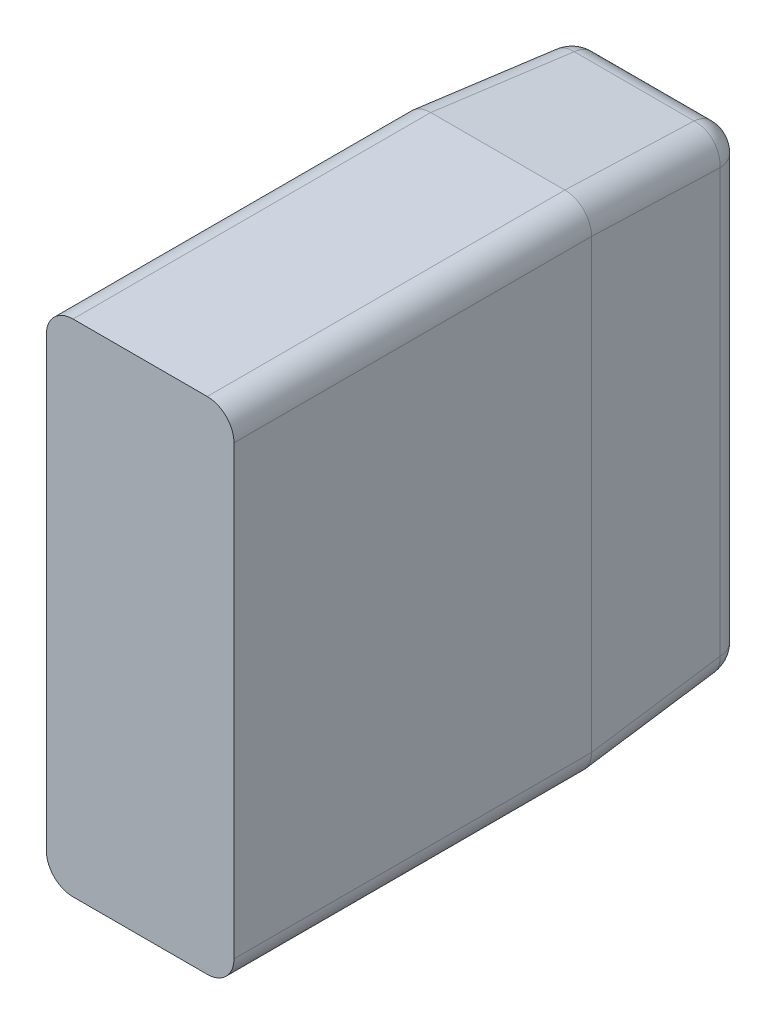
ISO-10303-21;
HEADER;
FILE_DESCRIPTION(('STEP AP214'),'2;1');
FILE_NAME('part.step','',(''),(''),'','','');
FILE_SCHEMA(('AUTOMOTIVE_DESIGN { 1 0 10303 214 1 1 1 1 }'));
ENDSEC;
DATA;
#1=APPLICATION_CONTEXT('core data for automotive mechanical design processes');
#2=APPLICATION_PROTOCOL_DEFINITION('international standard','automotive_design',2000,#1);
#3=PRODUCT_CONTEXT('',#1,'mechanical');
#4=PRODUCT('Part','Part','',(#3));
#5=PRODUCT_RELATED_PRODUCT_CATEGORY('part','',(#4));
#6=PRODUCT_DEFINITION_FORMATION('','',#4);
#7=PRODUCT_DEFINITION_CONTEXT('part definition',#1,'design');
#8=PRODUCT_DEFINITION('design','',#6,#7);
#9=PRODUCT_DEFINITION_SHAPE('','',#8);
#10=(LENGTH_UNIT() NAMED_UNIT(*) SI_UNIT(.MILLI.,.METRE.));
#11=(NAMED_UNIT(*) PLANE_ANGLE_UNIT() SI_UNIT($,.RADIAN.));
#12=(NAMED_UNIT(*) SI_UNIT($,.STERADIAN.) SOLID_ANGLE_UNIT());
#13=UNCERTAINTY_MEASURE_WITH_UNIT(LENGTH_MEASURE(1.E-05),#10,'distance_accuracy_value','');
#14=(GEOMETRIC_REPRESENTATION_CONTEXT(3) GLOBAL_UNCERTAINTY_ASSIGNED_CONTEXT((#13)) GLOBAL_UNIT_ASSIGNED_CONTEXT((#10,
#11,#12)) REPRESENTATION_CONTEXT('',''));
#15=CARTESIAN_POINT('',(0.,0.,0.));
#16=DIRECTION('',(0.,0.,1.));
#17=DIRECTION('',(1.,0.,0.));
#18=AXIS2_PLACEMENT_3D('',#15,#16,#17);
#19=CARTESIAN_POINT('',(14.4972590695092,80.,50.1046719124859));
#20=DIRECTION('',(0.998629534754574,0.,0.0523359562429439));
#21=DIRECTION('',(0.052335956242944,0.,-0.998629534754574));
#22=AXIS2_PLACEMENT_3D('',#19,#20,#21);
#23=PLANE('',#22);
#24=DIRECTION('',(0.,-1.,0.));
#25=VECTOR('',#24,1.);
#26=CARTESIAN_POINT('',(14.5027446919958,80.,50.));
#27=LINE('',#26,#25);
#28=CARTESIAN_POINT('',(14.5027446919958,25.0053627791186,50.));
#29=VERTEX_POINT('',#28);
#30=CARTESIAN_POINT('',(14.5027446919958,74.9946372208814,50.));
#31=VERTEX_POINT('',#30);
#32=EDGE_CURVE('E12',#29,#31,#27,.F.);
#33=ORIENTED_EDGE('',*,*,#32,.T.);
#34=DIRECTION('',(0.0521373445210819,-0.0870372042918475,-0.994839797341938));
#35=VECTOR('',#34,1.);
#36=CARTESIAN_POINT('',(14.4745868464784,75.0416434536543,50.5372836991502));
#37=LINE('',#36,#35);
#38=CARTESIAN_POINT('',(15.2970898149715,73.6685708593944,34.8429921312712));
#39=VERTEX_POINT('',#38);
#40=EDGE_CURVE('E245',#39,#31,#37,.F.);
#41=ORIENTED_EDGE('',*,*,#40,.F.);
#42=DIRECTION('',(0.,1.,0.));
#43=VECTOR('',#42,1.);
#44=CARTESIAN_POINT('',(15.2970898149715,80.,34.8429921312712));
#45=LINE('',#44,#43);
#46=CARTESIAN_POINT('',(15.2970898149715,26.3314291406056,34.8429921312712));
#47=VERTEX_POINT('',#46);
#48=EDGE_CURVE('E249',#47,#39,#45,.T.);
#49=ORIENTED_EDGE('',*,*,#48,.F.);
#50=DIRECTION('',(0.0521373445210819,0.0870372042918475,-0.994839797341938));
#51=VECTOR('',#50,1.);
#52=CARTESIAN_POINT('',(14.4745868464784,24.9583565463457,50.5372836991502));
#53=LINE('',#52,#51);
#54=EDGE_CURVE('E103',#29,#47,#53,.T.);
#55=ORIENTED_EDGE('',*,*,#54,.F.);
#56=EDGE_LOOP('',(#33,#41,#49,#55));
#57=FACE_BOUND('',#56,.T.);
#58=ADVANCED_FACE('F38',(#57),#23,.F.);
#59=CARTESIAN_POINT('',(17.4704754507421,24.9583565463457,50.6942915678791));
#60=DIRECTION('',(0.0521373445210819,0.0870372042918475,-0.994839797341938));
#61=DIRECTION('',(0.,0.996194698091746,0.0871557427476584));
#62=AXIS2_PLACEMENT_3D('',#59,#60,#61);
#63=CYLINDRICAL_SURFACE('',#62,3.);
#64=CARTESIAN_POINT('',(17.5068617299896,25.0190991877167,50.));
#65=DIRECTION('',(0.,0.,1.));
#66=DIRECTION('',(0.5138797648823,0.857862219266306,0.));
#67=AXIS2_PLACEMENT_3D('',#64,#65,#66);
#68=ELLIPSE('',#67,3.01556090539959,3.);
#69=CARTESIAN_POINT('',(17.4931588132021,22.0076396750867,50.));
#70=VERTEX_POINT('',#69);
#71=EDGE_CURVE('E46',#70,#29,#68,.F.);
#72=ORIENTED_EDGE('',*,*,#71,.T.);
#73=ORIENTED_EDGE('',*,*,#54,.T.);
#74=CARTESIAN_POINT('',(18.2929784192352,26.3314291406056,35.));
#75=DIRECTION('',(0.0521373445210819,0.0870372042918475,-0.994839797341938));
#76=DIRECTION('',(0.,0.996194698091746,0.0871557427476584));
#77=AXIS2_PLACEMENT_3D('',#74,#75,#76);
#78=CIRCLE('',#77,3.);
#79=CARTESIAN_POINT('',(18.2929784192352,23.3428450463304,34.738532771757));
#80=VERTEX_POINT('',#79);
#81=EDGE_CURVE('E310',#47,#80,#78,.F.);
#82=ORIENTED_EDGE('',*,*,#81,.T.);
#83=DIRECTION('',(0.0521373445210819,0.0870372042918475,-0.994839797341938));
#84=VECTOR('',#83,1.);
#85=CARTESIAN_POINT('',(17.4704754507421,21.9697724520704,50.4328243396361));
#86=LINE('',#85,#84);
#87=EDGE_CURVE('E248',#80,#70,#86,.F.);
#88=ORIENTED_EDGE('',*,*,#87,.T.);
#89=EDGE_LOOP('',(#72,#73,#82,#88));
#90=FACE_BOUND('',#89,.T.);
#91=ADVANCED_FACE('F334',(#90),#63,.T.);
#92=CARTESIAN_POINT('',(12.5,21.9923893961835,50.1743114854953));
#93=DIRECTION('',(0.,0.996194698091746,0.0871557427476584));
#94=DIRECTION('',(0.,-0.0871557427476584,0.996194698091746));
#95=AXIS2_PLACEMENT_3D('',#92,#93,#94);
#96=PLANE('',#95);
#97=DIRECTION('',(1.,0.,0.));
#98=VECTOR('',#97,1.);
#99=CARTESIAN_POINT('',(12.5,22.0076396750867,50.));
#100=LINE('',#99,#98);
#101=CARTESIAN_POINT('',(32.5068411867979,22.0076396750867,50.));
#102=VERTEX_POINT('',#101);
#103=EDGE_CURVE('E237',#102,#70,#100,.F.);
#104=ORIENTED_EDGE('',*,*,#103,.T.);
#105=ORIENTED_EDGE('',*,*,#87,.F.);
#106=DIRECTION('',(1.,0.,0.));
#107=VECTOR('',#106,1.);
#108=CARTESIAN_POINT('',(12.5,23.3428450463304,34.738532771757));
#109=LINE('',#108,#107);
#110=CARTESIAN_POINT('',(31.7070215807648,23.3428450463304,34.738532771757));
#111=VERTEX_POINT('',#110);
#112=EDGE_CURVE('E295',#111,#80,#109,.F.);
#113=ORIENTED_EDGE('',*,*,#112,.F.);
#114=DIRECTION('',(-0.0521373445210819,0.0870372042918475,-0.994839797341938));
#115=VECTOR('',#114,1.);
#116=CARTESIAN_POINT('',(32.2572512268789,22.4243009479269,45.2375398589015));
#117=LINE('',#116,#115);
#118=EDGE_CURVE('E292',#102,#111,#117,.T.);
#119=ORIENTED_EDGE('',*,*,#118,.F.);
#120=EDGE_LOOP('',(#104,#105,#113,#119));
#121=FACE_BOUND('',#120,.T.);
#122=ADVANCED_FACE('F358',(#121),#96,.F.);
#123=CARTESIAN_POINT('',(0.,26.3314291406056,35.));
#124=DIRECTION('',(-1.,0.,0.));
#125=DIRECTION('',(0.,0.,1.));
#126=AXIS2_PLACEMENT_3D('',#123,#124,#125);
#127=CYLINDRICAL_SURFACE('',#126,3.);
#128=CARTESIAN_POINT('',(18.2929784192352,26.3314291406056,35.));
#129=DIRECTION('',(-1.,0.,0.));
#130=DIRECTION('',(0.,-1.,0.));
#131=AXIS2_PLACEMENT_3D('',#128,#129,#130);
#132=CIRCLE('',#131,3.);
#133=CARTESIAN_POINT('',(18.2929784192352,26.3314291406056,32.));
#134=VERTEX_POINT('',#133);
#135=EDGE_CURVE('E294',#80,#134,#132,.F.);
#136=ORIENTED_EDGE('',*,*,#135,.T.);
#137=DIRECTION('',(1.,0.,0.));
#138=VECTOR('',#137,1.);
#139=CARTESIAN_POINT('',(0.,26.3314291406056,32.));
#140=LINE('',#139,#138);
#141=CARTESIAN_POINT('',(31.7070215807648,26.3314291406056,32.));
#142=VERTEX_POINT('',#141);
#143=EDGE_CURVE('E299',#134,#142,#140,.T.);
#144=ORIENTED_EDGE('',*,*,#143,.T.);
#145=CARTESIAN_POINT('',(31.7070215807648,26.3314291406056,35.));
#146=DIRECTION('',(-1.,0.,0.));
#147=DIRECTION('',(0.,-1.,0.));
#148=AXIS2_PLACEMENT_3D('',#145,#146,#147);
#149=CIRCLE('',#148,3.);
#150=EDGE_CURVE('E296',#142,#111,#149,.T.);
#151=ORIENTED_EDGE('',*,*,#150,.T.);
#152=ORIENTED_EDGE('',*,*,#112,.T.);
#153=EDGE_LOOP('',(#136,#144,#151,#152));
#154=FACE_BOUND('',#153,.T.);
#155=ADVANCED_FACE('F353',(#154),#127,.T.);
#156=CARTESIAN_POINT('',(18.2929784192352,26.3314291406056,35.));
#157=DIRECTION('',(0.,0.,1.));
#158=DIRECTION('',(1.,0.,0.));
#159=AXIS2_PLACEMENT_3D('',#156,#157,#158);
#160=SPHERICAL_SURFACE('',#159,3.);
#161=ORIENTED_EDGE('',*,*,#81,.F.);
#162=CARTESIAN_POINT('',(18.2929784192352,26.3314291406056,35.));
#163=DIRECTION('',(0.,1.,0.));
#164=DIRECTION('',(0.,0.,1.));
#165=AXIS2_PLACEMENT_3D('',#162,#163,#164);
#166=CIRCLE('',#165,3.);
#167=EDGE_CURVE('E304',#47,#134,#166,.F.);
#168=ORIENTED_EDGE('',*,*,#167,.T.);
#169=ORIENTED_EDGE('',*,*,#135,.F.);
#170=EDGE_LOOP('',(#161,#168,#169));
#171=FACE_BOUND('',#170,.T.);
#172=ADVANCED_FACE('F343',(#171),#160,.T.);
#173=CARTESIAN_POINT('',(18.2929784192352,0.,35.));
#174=DIRECTION('',(0.,1.,0.));
#175=DIRECTION('',(0.,0.,1.));
#176=AXIS2_PLACEMENT_3D('',#173,#174,#175);
#177=CYLINDRICAL_SURFACE('',#176,3.);
#178=ORIENTED_EDGE('',*,*,#167,.F.);
#179=ORIENTED_EDGE('',*,*,#48,.T.);
#180=CARTESIAN_POINT('',(18.2929784192352,73.6685708593944,35.));
#181=DIRECTION('',(0.,1.,0.));
#182=DIRECTION('',(-1.,0.,0.));
#183=AXIS2_PLACEMENT_3D('',#180,#181,#182);
#184=CIRCLE('',#183,3.);
#185=CARTESIAN_POINT('',(18.2929784192352,73.6685708593944,32.));
#186=VERTEX_POINT('',#185);
#187=EDGE_CURVE('E257',#39,#186,#184,.F.);
#188=ORIENTED_EDGE('',*,*,#187,.T.);
#189=DIRECTION('',(0.,1.,0.));
#190=VECTOR('',#189,1.);
#191=CARTESIAN_POINT('',(18.2929784192352,0.,32.));
#192=LINE('',#191,#190);
#193=EDGE_CURVE('E261',#186,#134,#192,.F.);
#194=ORIENTED_EDGE('',*,*,#193,.T.);
#195=EDGE_LOOP('',(#178,#179,#188,#194));
#196=FACE_BOUND('',#195,.T.);
#197=ADVANCED_FACE('F344',(#196),#177,.T.);
#198=CARTESIAN_POINT('',(0.,0.,32.));
#199=DIRECTION('',(0.,0.,1.));
#200=DIRECTION('',(1.,0.,0.));
#201=AXIS2_PLACEMENT_3D('',#198,#199,#200);
#202=PLANE('',#201);
#203=DIRECTION('',(0.,1.,0.));
#204=VECTOR('',#203,1.);
#205=CARTESIAN_POINT('',(31.7070215807648,0.,32.));
#206=LINE('',#205,#204);
#207=CARTESIAN_POINT('',(31.7070215807648,73.6685708593944,32.));
#208=VERTEX_POINT('',#207);
#209=EDGE_CURVE('E260',#142,#208,#206,.T.);
#210=ORIENTED_EDGE('',*,*,#209,.F.);
#211=ORIENTED_EDGE('',*,*,#143,.F.);
#212=ORIENTED_EDGE('',*,*,#193,.F.);
#213=DIRECTION('',(1.,0.,0.));
#214=VECTOR('',#213,1.);
#215=CARTESIAN_POINT('',(0.,73.6685708593944,32.));
#216=LINE('',#215,#214);
#217=EDGE_CURVE('E269',#208,#186,#216,.F.);
#218=ORIENTED_EDGE('',*,*,#217,.F.);
#219=EDGE_LOOP('',(#210,#211,#212,#218));
#220=FACE_BOUND('',#219,.T.);
#221=ADVANCED_FACE('F349',(#220),#202,.F.);
#222=CARTESIAN_POINT('',(31.7070215807648,0.,35.));
#223=DIRECTION('',(0.,-1.,0.));
#224=DIRECTION('',(0.,0.,-1.));
#225=AXIS2_PLACEMENT_3D('',#222,#223,#224);
#226=CYLINDRICAL_SURFACE('',#225,3.);
#227=CARTESIAN_POINT('',(31.7070215807648,26.3314291406056,35.));
#228=DIRECTION('',(0.,-1.,0.));
#229=DIRECTION('',(0.,0.,-1.));
#230=AXIS2_PLACEMENT_3D('',#227,#228,#229);
#231=CIRCLE('',#230,3.);
#232=CARTESIAN_POINT('',(34.7029101850285,26.3314291406056,34.8429921312712));
#233=VERTEX_POINT('',#232);
#234=EDGE_CURVE('E272',#142,#233,#231,.T.);
#235=ORIENTED_EDGE('',*,*,#234,.F.);
#236=ORIENTED_EDGE('',*,*,#209,.T.);
#237=CARTESIAN_POINT('',(31.7070215807648,73.6685708593944,35.));
#238=DIRECTION('',(0.,-1.,0.));
#239=DIRECTION('',(1.,0.,0.));
#240=AXIS2_PLACEMENT_3D('',#237,#238,#239);
#241=CIRCLE('',#240,3.);
#242=CARTESIAN_POINT('',(34.7029101850285,73.6685708593944,34.8429921312712));
#243=VERTEX_POINT('',#242);
#244=EDGE_CURVE('E273',#208,#243,#241,.T.);
#245=ORIENTED_EDGE('',*,*,#244,.T.);
#246=DIRECTION('',(0.,1.,0.));
#247=VECTOR('',#246,1.);
#248=CARTESIAN_POINT('',(34.7029101850285,80.,34.8429921312712));
#249=LINE('',#248,#247);
#250=EDGE_CURVE('E277',#243,#233,#249,.F.);
#251=ORIENTED_EDGE('',*,*,#250,.T.);
#252=EDGE_LOOP('',(#235,#236,#245,#251));
#253=FACE_BOUND('',#252,.T.);
#254=ADVANCED_FACE('F407',(#253),#226,.T.);
#255=CARTESIAN_POINT('',(31.7070215807648,26.3314291406056,35.));
#256=DIRECTION('',(0.,0.,1.));
#257=DIRECTION('',(1.,0.,0.));
#258=AXIS2_PLACEMENT_3D('',#255,#256,#257);
#259=SPHERICAL_SURFACE('',#258,3.);
#260=ORIENTED_EDGE('',*,*,#150,.F.);
#261=ORIENTED_EDGE('',*,*,#234,.T.);
#262=CARTESIAN_POINT('',(31.7070215807648,26.3314291406056,35.));
#263=DIRECTION('',(-0.0521373445210819,0.0870372042918475,-0.994839797341938));
#264=DIRECTION('',(0.,0.996194698091746,0.0871557427476584));
#265=AXIS2_PLACEMENT_3D('',#262,#263,#264);
#266=CIRCLE('',#265,3.);
#267=EDGE_CURVE('E276',#111,#233,#266,.F.);
#268=ORIENTED_EDGE('',*,*,#267,.F.);
#269=EDGE_LOOP('',(#260,#261,#268));
#270=FACE_BOUND('',#269,.T.);
#271=ADVANCED_FACE('F404',(#270),#259,.T.);
#272=CARTESIAN_POINT('',(32.2572512268789,25.4128850422021,45.4990070871444));
#273=DIRECTION('',(-0.0521373445210819,0.0870372042918475,-0.994839797341938));
#274=DIRECTION('',(0.,0.996194698091746,0.0871557427476584));
#275=AXIS2_PLACEMENT_3D('',#272,#273,#274);
#276=CYLINDRICAL_SURFACE('',#275,3.);
#277=CARTESIAN_POINT('',(32.4931382700104,25.0190991877168,50.));
#278=DIRECTION('',(0.,0.,1.));
#279=DIRECTION('',(-0.5138797648823,0.857862219266306,0.));
#280=AXIS2_PLACEMENT_3D('',#277,#278,#279);
#281=ELLIPSE('',#280,3.01556090539959,3.);
#282=CARTESIAN_POINT('',(35.4972553080042,25.0053627791186,50.));
#283=VERTEX_POINT('',#282);
#284=EDGE_CURVE('E240',#283,#102,#281,.F.);
#285=ORIENTED_EDGE('',*,*,#284,.T.);
#286=ORIENTED_EDGE('',*,*,#118,.T.);
#287=ORIENTED_EDGE('',*,*,#267,.T.);
#288=DIRECTION('',(-0.0521373445210819,0.0870372042918475,-0.994839797341938));
#289=VECTOR('',#288,1.);
#290=CARTESIAN_POINT('',(35.2531398311427,25.4128850422021,45.3419992184156));
#291=LINE('',#290,#289);
#292=EDGE_CURVE('E285',#233,#283,#291,.F.);
#293=ORIENTED_EDGE('',*,*,#292,.T.);
#294=EDGE_LOOP('',(#285,#286,#287,#293));
#295=FACE_BOUND('',#294,.T.);
#296=ADVANCED_FACE('F360',(#295),#276,.T.);
#297=CARTESIAN_POINT('',(35.5027409304909,80.,50.1046719124859));
#298=DIRECTION('',(-0.998629534754574,0.,0.0523359562429439));
#299=DIRECTION('',(0.052335956242944,0.,0.998629534754574));
#300=AXIS2_PLACEMENT_3D('',#297,#298,#299);
#301=PLANE('',#300);
#302=DIRECTION('',(0.,1.,0.));
#303=VECTOR('',#302,1.);
#304=CARTESIAN_POINT('',(35.4972553080042,80.,50.));
#305=LINE('',#304,#303);
#306=CARTESIAN_POINT('',(35.4972553080042,74.9946372208814,50.));
#307=VERTEX_POINT('',#306);
#308=EDGE_CURVE('E137',#307,#283,#305,.F.);
#309=ORIENTED_EDGE('',*,*,#308,.T.);
#310=ORIENTED_EDGE('',*,*,#292,.F.);
#311=ORIENTED_EDGE('',*,*,#250,.F.);
#312=DIRECTION('',(-0.0521373445210819,-0.0870372042918475,-0.994839797341938));
#313=VECTOR('',#312,1.);
#314=CARTESIAN_POINT('',(35.4574555861789,74.9281962359964,49.2405760677177));
#315=LINE('',#314,#313);
#316=EDGE_CURVE('E283',#307,#243,#315,.T.);
#317=ORIENTED_EDGE('',*,*,#316,.F.);
#318=EDGE_LOOP('',(#309,#310,#311,#317));
#319=FACE_BOUND('',#318,.T.);
#320=ADVANCED_FACE('F364',(#319),#301,.F.);
#321=CARTESIAN_POINT('',(32.4615669819151,74.9281962359964,49.3975839364466));
#322=DIRECTION('',(-0.0521373445210819,-0.0870372042918475,-0.994839797341938));
#323=DIRECTION('',(0.,0.996194698091746,-0.0871557427476584));
#324=AXIS2_PLACEMENT_3D('',#321,#322,#323);
#325=CYLINDRICAL_SURFACE('',#324,3.);
#326=CARTESIAN_POINT('',(32.4931382700104,74.9809008122833,50.));
#327=DIRECTION('',(0.,0.,1.));
#328=DIRECTION('',(-0.5138797648823,-0.857862219266306,0.));
#329=AXIS2_PLACEMENT_3D('',#326,#327,#328);
#330=ELLIPSE('',#329,3.01556090539959,3.);
#331=CARTESIAN_POINT('',(32.5068411867979,77.9923603249133,50.));
#332=VERTEX_POINT('',#331);
#333=EDGE_CURVE('E322',#332,#307,#330,.F.);
#334=ORIENTED_EDGE('',*,*,#333,.T.);
#335=ORIENTED_EDGE('',*,*,#316,.T.);
#336=CARTESIAN_POINT('',(31.7070215807648,73.6685708593944,35.));
#337=DIRECTION('',(-0.0521373445210819,-0.0870372042918475,-0.994839797341938));
#338=DIRECTION('',(0.,0.996194698091746,-0.0871557427476584));
#339=AXIS2_PLACEMENT_3D('',#336,#337,#338);
#340=CIRCLE('',#339,3.);
#341=CARTESIAN_POINT('',(31.7070215807648,76.6571549536696,34.738532771757));
#342=VERTEX_POINT('',#341);
#343=EDGE_CURVE('E268',#243,#342,#340,.F.);
#344=ORIENTED_EDGE('',*,*,#343,.T.);
#345=DIRECTION('',(-0.0521373445210819,-0.0870372042918475,-0.994839797341938));
#346=VECTOR('',#345,1.);
#347=CARTESIAN_POINT('',(32.4615669819151,77.9167803302717,49.1361167082036));
#348=LINE('',#347,#346);
#349=EDGE_CURVE('E280',#342,#332,#348,.F.);
#350=ORIENTED_EDGE('',*,*,#349,.T.);
#351=EDGE_LOOP('',(#334,#335,#344,#350));
#352=FACE_BOUND('',#351,.T.);
#353=ADVANCED_FACE('F367',(#352),#325,.T.);
#354=CARTESIAN_POINT('',(12.5,78.0076106038165,50.1743114854953));
#355=DIRECTION('',(0.,-0.996194698091746,0.0871557427476584));
#356=DIRECTION('',(0.,-0.0871557427476584,-0.996194698091746));
#357=AXIS2_PLACEMENT_3D('',#354,#355,#356);
#358=PLANE('',#357);
#359=DIRECTION('',(-1.,0.,0.));
#360=VECTOR('',#359,1.);
#361=CARTESIAN_POINT('',(12.5,77.9923603249133,50.));
#362=LINE('',#361,#360);
#363=CARTESIAN_POINT('',(17.4931588132021,77.9923603249133,50.));
#364=VERTEX_POINT('',#363);
#365=EDGE_CURVE('E141',#364,#332,#362,.F.);
#366=ORIENTED_EDGE('',*,*,#365,.T.);
#367=ORIENTED_EDGE('',*,*,#349,.F.);
#368=DIRECTION('',(1.,0.,0.));
#369=VECTOR('',#368,1.);
#370=CARTESIAN_POINT('',(12.5,76.6571549536696,34.738532771757));
#371=LINE('',#370,#369);
#372=CARTESIAN_POINT('',(18.2929784192352,76.6571549536696,34.738532771757));
#373=VERTEX_POINT('',#372);
#374=EDGE_CURVE('E256',#373,#342,#371,.T.);
#375=ORIENTED_EDGE('',*,*,#374,.F.);
#376=DIRECTION('',(0.0521373445210819,-0.0870372042918475,-0.994839797341938));
#377=VECTOR('',#376,1.);
#378=CARTESIAN_POINT('',(17.4704754507421,78.0302275479296,50.4328243396361));
#379=LINE('',#378,#377);
#380=EDGE_CURVE('E62',#364,#373,#379,.T.);
#381=ORIENTED_EDGE('',*,*,#380,.F.);
#382=EDGE_LOOP('',(#366,#367,#375,#381));
#383=FACE_BOUND('',#382,.T.);
#384=ADVANCED_FACE('F370',(#383),#358,.F.);
#385=CARTESIAN_POINT('',(0.,73.6685708593944,35.));
#386=DIRECTION('',(1.,0.,0.));
#387=DIRECTION('',(0.,0.,-1.));
#388=AXIS2_PLACEMENT_3D('',#385,#386,#387);
#389=CYLINDRICAL_SURFACE('',#388,3.);
#390=CARTESIAN_POINT('',(31.7070215807648,73.6685708593944,35.));
#391=DIRECTION('',(1.,0.,0.));
#392=DIRECTION('',(0.,0.,-1.));
#393=AXIS2_PLACEMENT_3D('',#390,#391,#392);
#394=CIRCLE('',#393,3.);
#395=EDGE_CURVE('E255',#208,#342,#394,.T.);
#396=ORIENTED_EDGE('',*,*,#395,.F.);
#397=ORIENTED_EDGE('',*,*,#217,.T.);
#398=CARTESIAN_POINT('',(18.2929784192352,73.6685708593944,35.));
#399=DIRECTION('',(1.,0.,0.));
#400=DIRECTION('',(0.,0.,-1.));
#401=AXIS2_PLACEMENT_3D('',#398,#399,#400);
#402=CIRCLE('',#401,3.);
#403=EDGE_CURVE('E253',#373,#186,#402,.F.);
#404=ORIENTED_EDGE('',*,*,#403,.F.);
#405=ORIENTED_EDGE('',*,*,#374,.T.);
#406=EDGE_LOOP('',(#396,#397,#404,#405));
#407=FACE_BOUND('',#406,.T.);
#408=ADVANCED_FACE('F375',(#407),#389,.T.);
#409=CARTESIAN_POINT('',(31.7070215807648,73.6685708593944,35.));
#410=DIRECTION('',(0.,0.,1.));
#411=DIRECTION('',(1.,0.,0.));
#412=AXIS2_PLACEMENT_3D('',#409,#410,#411);
#413=SPHERICAL_SURFACE('',#412,3.);
#414=ORIENTED_EDGE('',*,*,#244,.F.);
#415=ORIENTED_EDGE('',*,*,#395,.T.);
#416=ORIENTED_EDGE('',*,*,#343,.F.);
#417=EDGE_LOOP('',(#414,#415,#416));
#418=FACE_BOUND('',#417,.T.);
#419=ADVANCED_FACE('F387',(#418),#413,.T.);
#420=CARTESIAN_POINT('',(18.2929784192352,73.6685708593944,35.));
#421=DIRECTION('',(0.,0.,1.));
#422=DIRECTION('',(1.,0.,0.));
#423=AXIS2_PLACEMENT_3D('',#420,#421,#422);
#424=SPHERICAL_SURFACE('',#423,3.);
#425=CARTESIAN_POINT('',(18.2929784192352,73.6685708593944,35.));
#426=DIRECTION('',(0.0521373445210819,-0.0870372042918475,-0.994839797341938));
#427=DIRECTION('',(0.,0.996194698091746,-0.0871557427476584));
#428=AXIS2_PLACEMENT_3D('',#425,#426,#427);
#429=CIRCLE('',#428,3.);
#430=EDGE_CURVE('E250',#373,#39,#429,.F.);
#431=ORIENTED_EDGE('',*,*,#430,.F.);
#432=ORIENTED_EDGE('',*,*,#403,.T.);
#433=ORIENTED_EDGE('',*,*,#187,.F.);
#434=EDGE_LOOP('',(#431,#432,#433));
#435=FACE_BOUND('',#434,.T.);
#436=ADVANCED_FACE('F377',(#435),#424,.T.);
#437=CARTESIAN_POINT('',(17.4704754507421,75.0416434536543,50.6942915678791));
#438=DIRECTION('',(0.0521373445210819,-0.0870372042918475,-0.994839797341938));
#439=DIRECTION('',(0.,0.996194698091746,-0.0871557427476584));
#440=AXIS2_PLACEMENT_3D('',#437,#438,#439);
#441=CYLINDRICAL_SURFACE('',#440,3.);
#442=CARTESIAN_POINT('',(17.5068617299896,74.9809008122833,50.));
#443=DIRECTION('',(0.,0.,1.));
#444=DIRECTION('',(0.5138797648823,-0.857862219266306,0.));
#445=AXIS2_PLACEMENT_3D('',#442,#443,#444);
#446=ELLIPSE('',#445,3.01556090539959,3.);
#447=EDGE_CURVE('E252',#31,#364,#446,.F.);
#448=ORIENTED_EDGE('',*,*,#447,.T.);
#449=ORIENTED_EDGE('',*,*,#380,.T.);
#450=ORIENTED_EDGE('',*,*,#430,.T.);
#451=ORIENTED_EDGE('',*,*,#40,.T.);
#452=EDGE_LOOP('',(#448,#449,#450,#451));
#453=FACE_BOUND('',#452,.T.);
#454=ADVANCED_FACE('F215',(#453),#441,.T.);
#455=CARTESIAN_POINT('',(17.5068617299896,74.9809008122833,90.));
#456=DIRECTION('',(0.,0.,1.));
#457=DIRECTION('',(0.513879764882301,-0.857862219266306,0.));
#458=AXIS2_PLACEMENT_3D('',#455,#456,#457);
#459=ELLIPSE('',#458,3.01556090539959,3.);
#460=DIRECTION('',(0.,0.,-1.));
#461=VECTOR('',#460,1.);
#462=SURFACE_OF_LINEAR_EXTRUSION('',#459,#461);
#463=ORIENTED_EDGE('',*,*,#447,.F.);
#464=DIRECTION('',(0.,0.,-1.));
#465=VECTOR('',#464,1.);
#466=CARTESIAN_POINT('',(14.5027446919958,74.9946372208814,90.));
#467=LINE('',#466,#465);
#468=CARTESIAN_POINT('',(14.5027446919958,74.9946372208814,90.));
#469=VERTEX_POINT('',#468);
#470=EDGE_CURVE('E226',#469,#31,#467,.T.);
#471=ORIENTED_EDGE('',*,*,#470,.F.);
#472=CARTESIAN_POINT('',(17.4931588132021,77.9923603249133,90.));
#473=VERTEX_POINT('',#472);
#474=EDGE_CURVE('E218',#473,#469,#459,.T.);
#475=ORIENTED_EDGE('',*,*,#474,.F.);
#476=DIRECTION('',(0.,0.,-1.));
#477=VECTOR('',#476,1.);
#478=CARTESIAN_POINT('',(17.4931588132021,77.9923603249133,90.));
#479=LINE('',#478,#477);
#480=EDGE_CURVE('E178',#473,#364,#479,.T.);
#481=ORIENTED_EDGE('',*,*,#480,.T.);
#482=EDGE_LOOP('',(#463,#471,#475,#481));
#483=FACE_BOUND('',#482,.T.);
#484=ADVANCED_FACE('F212',(#483),#462,.F.);
#485=CARTESIAN_POINT('',(14.5027446919958,74.9946372208814,90.));
#486=DIRECTION('',(1.,0.,0.));
#487=DIRECTION('',(0.,1.,0.));
#488=AXIS2_PLACEMENT_3D('',#485,#486,#487);
#489=PLANE('',#488);
#490=ORIENTED_EDGE('',*,*,#32,.F.);
#491=DIRECTION('',(0.,0.,-1.));
#492=VECTOR('',#491,1.);
#493=CARTESIAN_POINT('',(14.5027446919958,25.0053627791186,90.));
#494=LINE('',#493,#492);
#495=CARTESIAN_POINT('',(14.5027446919958,25.0053627791186,90.));
#496=VERTEX_POINT('',#495);
#497=EDGE_CURVE('E225',#496,#29,#494,.T.);
#498=ORIENTED_EDGE('',*,*,#497,.F.);
#499=DIRECTION('',(0.,-1.,0.));
#500=VECTOR('',#499,1.);
#501=CARTESIAN_POINT('',(14.5027446919958,74.9946372208814,90.));
#502=LINE('',#501,#500);
#503=EDGE_CURVE('E149',#469,#496,#502,.T.);
#504=ORIENTED_EDGE('',*,*,#503,.F.);
#505=ORIENTED_EDGE('',*,*,#470,.T.);
#506=EDGE_LOOP('',(#490,#498,#504,#505));
#507=FACE_BOUND('',#506,.T.);
#508=ADVANCED_FACE('F208',(#507),#489,.F.);
#509=CARTESIAN_POINT('',(17.5068617299896,25.0190991877167,90.));
#510=DIRECTION('',(0.,0.,1.));
#511=DIRECTION('',(0.5138797648823,0.857862219266306,0.));
#512=AXIS2_PLACEMENT_3D('',#509,#510,#511);
#513=ELLIPSE('',#512,3.01556090539959,3.);
#514=DIRECTION('',(0.,0.,-1.));
#515=VECTOR('',#514,1.);
#516=SURFACE_OF_LINEAR_EXTRUSION('',#513,#515);
#517=ORIENTED_EDGE('',*,*,#71,.F.);
#518=DIRECTION('',(0.,0.,-1.));
#519=VECTOR('',#518,1.);
#520=CARTESIAN_POINT('',(17.4931588132021,22.0076396750867,90.));
#521=LINE('',#520,#519);
#522=CARTESIAN_POINT('',(17.4931588132021,22.0076396750867,90.));
#523=VERTEX_POINT('',#522);
#524=EDGE_CURVE('E227',#523,#70,#521,.T.);
#525=ORIENTED_EDGE('',*,*,#524,.F.);
#526=EDGE_CURVE('E201',#496,#523,#513,.T.);
#527=ORIENTED_EDGE('',*,*,#526,.F.);
#528=ORIENTED_EDGE('',*,*,#497,.T.);
#529=EDGE_LOOP('',(#517,#525,#527,#528));
#530=FACE_BOUND('',#529,.T.);
#531=ADVANCED_FACE('F205',(#530),#516,.F.);
#532=CARTESIAN_POINT('',(17.4931588132021,22.0076396750867,90.));
#533=DIRECTION('',(0.,1.,0.));
#534=DIRECTION('',(-1.,0.,0.));
#535=AXIS2_PLACEMENT_3D('',#532,#533,#534);
#536=PLANE('',#535);
#537=ORIENTED_EDGE('',*,*,#103,.F.);
#538=DIRECTION('',(0.,0.,-1.));
#539=VECTOR('',#538,1.);
#540=CARTESIAN_POINT('',(32.5068411867979,22.0076396750867,90.));
#541=LINE('',#540,#539);
#542=CARTESIAN_POINT('',(32.5068411867979,22.0076396750867,90.));
#543=VERTEX_POINT('',#542);
#544=EDGE_CURVE('E233',#543,#102,#541,.T.);
#545=ORIENTED_EDGE('',*,*,#544,.F.);
#546=DIRECTION('',(1.,0.,0.));
#547=VECTOR('',#546,1.);
#548=CARTESIAN_POINT('',(17.4931588132021,22.0076396750867,90.));
#549=LINE('',#548,#547);
#550=EDGE_CURVE('E199',#523,#543,#549,.T.);
#551=ORIENTED_EDGE('',*,*,#550,.F.);
#552=ORIENTED_EDGE('',*,*,#524,.T.);
#553=EDGE_LOOP('',(#537,#545,#551,#552));
#554=FACE_BOUND('',#553,.T.);
#555=ADVANCED_FACE('F194',(#554),#536,.F.);
#556=CARTESIAN_POINT('',(32.4931382700104,25.0190991877168,90.));
#557=DIRECTION('',(0.,0.,1.));
#558=DIRECTION('',(-0.5138797648823,0.857862219266306,0.));
#559=AXIS2_PLACEMENT_3D('',#556,#557,#558);
#560=ELLIPSE('',#559,3.01556090539959,3.);
#561=DIRECTION('',(0.,0.,-1.));
#562=VECTOR('',#561,1.);
#563=SURFACE_OF_LINEAR_EXTRUSION('',#560,#562);
#564=ORIENTED_EDGE('',*,*,#284,.F.);
#565=DIRECTION('',(0.,0.,-1.));
#566=VECTOR('',#565,1.);
#567=CARTESIAN_POINT('',(35.4972553080042,25.0053627791186,90.));
#568=LINE('',#567,#566);
#569=CARTESIAN_POINT('',(35.4972553080042,25.0053627791186,90.));
#570=VERTEX_POINT('',#569);
#571=EDGE_CURVE('E174',#570,#283,#568,.T.);
#572=ORIENTED_EDGE('',*,*,#571,.F.);
#573=EDGE_CURVE('E167',#543,#570,#560,.T.);
#574=ORIENTED_EDGE('',*,*,#573,.F.);
#575=ORIENTED_EDGE('',*,*,#544,.T.);
#576=EDGE_LOOP('',(#564,#572,#574,#575));
#577=FACE_BOUND('',#576,.T.);
#578=ADVANCED_FACE('F191',(#577),#563,.F.);
#579=CARTESIAN_POINT('',(35.4972553080042,25.0053627791186,90.));
#580=DIRECTION('',(-1.,0.,0.));
#581=DIRECTION('',(0.,0.,1.));
#582=AXIS2_PLACEMENT_3D('',#579,#580,#581);
#583=PLANE('',#582);
#584=ORIENTED_EDGE('',*,*,#308,.F.);
#585=DIRECTION('',(0.,0.,-1.));
#586=VECTOR('',#585,1.);
#587=CARTESIAN_POINT('',(35.4972553080042,74.9946372208814,90.));
#588=LINE('',#587,#586);
#589=CARTESIAN_POINT('',(35.4972553080042,74.9946372208814,90.));
#590=VERTEX_POINT('',#589);
#591=EDGE_CURVE('E170',#590,#307,#588,.T.);
#592=ORIENTED_EDGE('',*,*,#591,.F.);
#593=DIRECTION('',(0.,1.,0.));
#594=VECTOR('',#593,1.);
#595=CARTESIAN_POINT('',(35.4972553080042,25.0053627791186,90.));
#596=LINE('',#595,#594);
#597=EDGE_CURVE('E162',#570,#590,#596,.T.);
#598=ORIENTED_EDGE('',*,*,#597,.F.);
#599=ORIENTED_EDGE('',*,*,#571,.T.);
#600=EDGE_LOOP('',(#584,#592,#598,#599));
#601=FACE_BOUND('',#600,.T.);
#602=ADVANCED_FACE('F171',(#601),#583,.F.);
#603=CARTESIAN_POINT('',(32.4931382700104,74.9809008122833,90.));
#604=DIRECTION('',(0.,0.,1.));
#605=DIRECTION('',(-0.513879764882301,-0.857862219266306,0.));
#606=AXIS2_PLACEMENT_3D('',#603,#604,#605);
#607=ELLIPSE('',#606,3.01556090539959,3.);
#608=DIRECTION('',(0.,0.,-1.));
#609=VECTOR('',#608,1.);
#610=SURFACE_OF_LINEAR_EXTRUSION('',#607,#609);
#611=ORIENTED_EDGE('',*,*,#333,.F.);
#612=DIRECTION('',(0.,0.,-1.));
#613=VECTOR('',#612,1.);
#614=CARTESIAN_POINT('',(32.5068411867979,77.9923603249133,90.));
#615=LINE('',#614,#613);
#616=CARTESIAN_POINT('',(32.5068411867979,77.9923603249133,90.));
#617=VERTEX_POINT('',#616);
#618=EDGE_CURVE('E53',#617,#332,#615,.T.);
#619=ORIENTED_EDGE('',*,*,#618,.F.);
#620=EDGE_CURVE('E165',#590,#617,#607,.T.);
#621=ORIENTED_EDGE('',*,*,#620,.F.);
#622=ORIENTED_EDGE('',*,*,#591,.T.);
#623=EDGE_LOOP('',(#611,#619,#621,#622));
#624=FACE_BOUND('',#623,.T.);
#625=ADVANCED_FACE('F176',(#624),#610,.F.);
#626=CARTESIAN_POINT('',(32.5068411867979,77.9923603249133,90.));
#627=DIRECTION('',(0.,-1.,0.));
#628=DIRECTION('',(1.,0.,0.));
#629=AXIS2_PLACEMENT_3D('',#626,#627,#628);
#630=PLANE('',#629);
#631=ORIENTED_EDGE('',*,*,#365,.F.);
#632=ORIENTED_EDGE('',*,*,#480,.F.);
#633=DIRECTION('',(-1.,0.,0.));
#634=VECTOR('',#633,1.);
#635=CARTESIAN_POINT('',(32.5068411867979,77.9923603249133,90.));
#636=LINE('',#635,#634);
#637=EDGE_CURVE('E111',#617,#473,#636,.T.);
#638=ORIENTED_EDGE('',*,*,#637,.F.);
#639=ORIENTED_EDGE('',*,*,#618,.T.);
#640=EDGE_LOOP('',(#631,#632,#638,#639));
#641=FACE_BOUND('',#640,.T.);
#642=ADVANCED_FACE('F187',(#641),#630,.F.);
#643=CARTESIAN_POINT('',(17.5068617299896,74.9809008122833,90.));
#644=DIRECTION('',(0.,0.,1.));
#645=DIRECTION('',(1.,0.,0.));
#646=AXIS2_PLACEMENT_3D('',#643,#644,#645);
#647=PLANE('',#646);
#648=ORIENTED_EDGE('',*,*,#474,.T.);
#649=ORIENTED_EDGE('',*,*,#503,.T.);
#650=ORIENTED_EDGE('',*,*,#526,.T.);
#651=ORIENTED_EDGE('',*,*,#550,.T.);
#652=ORIENTED_EDGE('',*,*,#573,.T.);
#653=ORIENTED_EDGE('',*,*,#597,.T.);
#654=ORIENTED_EDGE('',*,*,#620,.T.);
#655=ORIENTED_EDGE('',*,*,#637,.T.);
#656=EDGE_LOOP('',(#648,#649,#650,#651,#652,#653,#654,#655));
#657=FACE_BOUND('',#656,.T.);
#658=ADVANCED_FACE('F163',(#657),#647,.T.);
#659=CLOSED_SHELL('',(#58,#91,#122,#155,#172,#197,#221,#254,#271,#296,#320,#353,#384,#408,#419,
#436,#454,#484,#508,#531,#555,#578,#602,#625,#642,#658));
#660=MANIFOLD_SOLID_BREP('B2',#659);
#661=ADVANCED_BREP_SHAPE_REPRESENTATION('',(#18,#660),#14);
#662=SHAPE_DEFINITION_REPRESENTATION(#9,#661);
ENDSEC;
END-ISO-10303-21;
